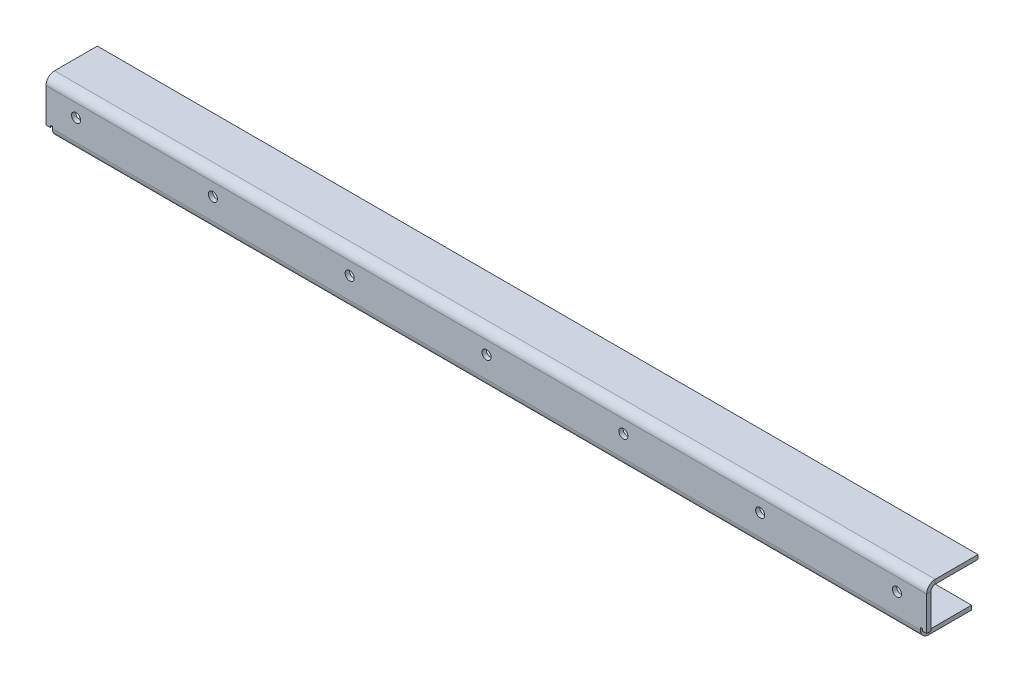
ISO-10303-21;
HEADER;
FILE_DESCRIPTION(('STEP AP214'),'2;1');
FILE_NAME('part.step','',(''),(''),'','','');
FILE_SCHEMA(('AUTOMOTIVE_DESIGN { 1 0 10303 214 1 1 1 1 }'));
ENDSEC;
DATA;
#1=APPLICATION_CONTEXT('core data for automotive mechanical design processes');
#2=APPLICATION_PROTOCOL_DEFINITION('international standard','automotive_design',2000,#1);
#3=PRODUCT_CONTEXT('',#1,'mechanical');
#4=PRODUCT('Part','Part','',(#3));
#5=PRODUCT_RELATED_PRODUCT_CATEGORY('part','',(#4));
#6=PRODUCT_DEFINITION_FORMATION('','',#4);
#7=PRODUCT_DEFINITION_CONTEXT('part definition',#1,'design');
#8=PRODUCT_DEFINITION('design','',#6,#7);
#9=PRODUCT_DEFINITION_SHAPE('','',#8);
#10=(LENGTH_UNIT() NAMED_UNIT(*) SI_UNIT(.MILLI.,.METRE.));
#11=(NAMED_UNIT(*) PLANE_ANGLE_UNIT() SI_UNIT($,.RADIAN.));
#12=(NAMED_UNIT(*) SI_UNIT($,.STERADIAN.) SOLID_ANGLE_UNIT());
#13=UNCERTAINTY_MEASURE_WITH_UNIT(LENGTH_MEASURE(1.E-05),#10,'distance_accuracy_value','');
#14=(GEOMETRIC_REPRESENTATION_CONTEXT(3) GLOBAL_UNCERTAINTY_ASSIGNED_CONTEXT((#13)) GLOBAL_UNIT_ASSIGNED_CONTEXT((#10,
#11,#12)) REPRESENTATION_CONTEXT('',''));
#15=CARTESIAN_POINT('',(0.,0.,0.));
#16=DIRECTION('',(0.,0.,1.));
#17=DIRECTION('',(1.,0.,0.));
#18=AXIS2_PLACEMENT_3D('',#15,#16,#17);
#19=CARTESIAN_POINT('',(631.951999999999,22.225,0.));
#20=DIRECTION('',(0.,0.,0.999999999999999));
#21=DIRECTION('',(0.999999999999999,0.,0.));
#22=AXIS2_PLACEMENT_3D('',#19,#20,#21);
#23=CYLINDRICAL_SURFACE('',#22,3.3734375);
#24=CARTESIAN_POINT('',(631.951999999999,22.225,0.));
#25=DIRECTION('',(0.,0.,0.999999999999999));
#26=DIRECTION('',(0.999999999999999,0.,0.));
#27=AXIS2_PLACEMENT_3D('',#24,#25,#26);
#28=CIRCLE('',#27,3.3734375);
#29=CARTESIAN_POINT('',(635.325437499999,22.225,0.));
#30=VERTEX_POINT('',#29);
#31=EDGE_CURVE('E83',#30,#30,#28,.T.);
#32=ORIENTED_EDGE('',*,*,#31,.T.);
#33=EDGE_LOOP('',(#32));
#34=FACE_BOUND('',#33,.T.);
#35=CARTESIAN_POINT('',(631.951999999999,22.225,-3.17500000000004));
#36=DIRECTION('',(0.,0.,-0.999999999999999));
#37=DIRECTION('',(-0.999999999999999,0.,0.));
#38=AXIS2_PLACEMENT_3D('',#35,#36,#37);
#39=CIRCLE('',#38,3.3734375);
#40=CARTESIAN_POINT('',(628.578562499999,22.225,-3.17500000000004));
#41=VERTEX_POINT('',#40);
#42=EDGE_CURVE('E13',#41,#41,#39,.T.);
#43=ORIENTED_EDGE('',*,*,#42,.T.);
#44=EDGE_LOOP('',(#43));
#45=FACE_BOUND('',#44,.T.);
#46=ADVANCED_FACE('F76',(#34,#45),#23,.F.);
#47=CARTESIAN_POINT('',(530.351999999999,22.225,0.));
#48=DIRECTION('',(0.,0.,0.999999999999999));
#49=DIRECTION('',(0.999999999999999,0.,0.));
#50=AXIS2_PLACEMENT_3D('',#47,#48,#49);
#51=CYLINDRICAL_SURFACE('',#50,3.3734375);
#52=CARTESIAN_POINT('',(530.351999999999,22.225,0.));
#53=DIRECTION('',(0.,0.,0.999999999999999));
#54=DIRECTION('',(0.999999999999999,0.,0.));
#55=AXIS2_PLACEMENT_3D('',#52,#53,#54);
#56=CIRCLE('',#55,3.3734375);
#57=CARTESIAN_POINT('',(533.725437499999,22.225,0.));
#58=VERTEX_POINT('',#57);
#59=EDGE_CURVE('E417',#58,#58,#56,.T.);
#60=ORIENTED_EDGE('',*,*,#59,.T.);
#61=EDGE_LOOP('',(#60));
#62=FACE_BOUND('',#61,.T.);
#63=CARTESIAN_POINT('',(530.351999999999,22.225,-3.17500000000004));
#64=DIRECTION('',(0.,0.,-0.999999999999999));
#65=DIRECTION('',(-0.999999999999999,0.,0.));
#66=AXIS2_PLACEMENT_3D('',#63,#64,#65);
#67=CIRCLE('',#66,3.3734375);
#68=CARTESIAN_POINT('',(526.978562499999,22.225,-3.17500000000004));
#69=VERTEX_POINT('',#68);
#70=EDGE_CURVE('E420',#69,#69,#67,.T.);
#71=ORIENTED_EDGE('',*,*,#70,.T.);
#72=EDGE_LOOP('',(#71));
#73=FACE_BOUND('',#72,.T.);
#74=ADVANCED_FACE('F446',(#62,#73),#51,.F.);
#75=CARTESIAN_POINT('',(428.751999999999,22.225,5.55111512312578E-13));
#76=DIRECTION('',(0.,0.,0.999999999999999));
#77=DIRECTION('',(0.999999999999999,0.,0.));
#78=AXIS2_PLACEMENT_3D('',#75,#76,#77);
#79=CYLINDRICAL_SURFACE('',#78,3.3734375);
#80=CARTESIAN_POINT('',(428.751999999999,22.225,5.55111512312578E-13));
#81=DIRECTION('',(0.,0.,0.999999999999999));
#82=DIRECTION('',(0.999999999999999,0.,0.));
#83=AXIS2_PLACEMENT_3D('',#80,#81,#82);
#84=CIRCLE('',#83,3.3734375);
#85=CARTESIAN_POINT('',(432.125437499999,22.225,5.55111512312578E-13));
#86=VERTEX_POINT('',#85);
#87=EDGE_CURVE('E411',#86,#86,#84,.T.);
#88=ORIENTED_EDGE('',*,*,#87,.T.);
#89=EDGE_LOOP('',(#88));
#90=FACE_BOUND('',#89,.T.);
#91=CARTESIAN_POINT('',(428.751999999999,22.225,-3.17499999999948));
#92=DIRECTION('',(0.,0.,-0.999999999999999));
#93=DIRECTION('',(-0.999999999999999,0.,0.));
#94=AXIS2_PLACEMENT_3D('',#91,#92,#93);
#95=CIRCLE('',#94,3.3734375);
#96=CARTESIAN_POINT('',(425.378562499999,22.225,-3.17499999999948));
#97=VERTEX_POINT('',#96);
#98=EDGE_CURVE('E414',#97,#97,#95,.T.);
#99=ORIENTED_EDGE('',*,*,#98,.T.);
#100=EDGE_LOOP('',(#99));
#101=FACE_BOUND('',#100,.T.);
#102=ADVANCED_FACE('F450',(#90,#101),#79,.F.);
#103=CARTESIAN_POINT('',(327.151999999999,22.225,5.55111512312578E-13));
#104=DIRECTION('',(0.,0.,0.999999999999999));
#105=DIRECTION('',(0.999999999999999,0.,0.));
#106=AXIS2_PLACEMENT_3D('',#103,#104,#105);
#107=CYLINDRICAL_SURFACE('',#106,3.3734375);
#108=CARTESIAN_POINT('',(327.151999999999,22.225,5.55111512312578E-13));
#109=DIRECTION('',(0.,0.,0.999999999999999));
#110=DIRECTION('',(0.999999999999999,0.,0.));
#111=AXIS2_PLACEMENT_3D('',#108,#109,#110);
#112=CIRCLE('',#111,3.3734375);
#113=CARTESIAN_POINT('',(330.525437499999,22.225,5.55111512312578E-13));
#114=VERTEX_POINT('',#113);
#115=EDGE_CURVE('E405',#114,#114,#112,.T.);
#116=ORIENTED_EDGE('',*,*,#115,.T.);
#117=EDGE_LOOP('',(#116));
#118=FACE_BOUND('',#117,.T.);
#119=CARTESIAN_POINT('',(327.151999999999,22.225,-3.17499999999948));
#120=DIRECTION('',(0.,0.,-0.999999999999999));
#121=DIRECTION('',(-0.999999999999999,0.,0.));
#122=AXIS2_PLACEMENT_3D('',#119,#120,#121);
#123=CIRCLE('',#122,3.3734375);
#124=CARTESIAN_POINT('',(323.778562499999,22.225,-3.17499999999948));
#125=VERTEX_POINT('',#124);
#126=EDGE_CURVE('E408',#125,#125,#123,.T.);
#127=ORIENTED_EDGE('',*,*,#126,.T.);
#128=EDGE_LOOP('',(#127));
#129=FACE_BOUND('',#128,.T.);
#130=ADVANCED_FACE('F455',(#118,#129),#107,.F.);
#131=CARTESIAN_POINT('',(225.552,22.225,5.55111512312578E-13));
#132=DIRECTION('',(0.,0.,0.999999999999999));
#133=DIRECTION('',(0.999999999999999,0.,0.));
#134=AXIS2_PLACEMENT_3D('',#131,#132,#133);
#135=CYLINDRICAL_SURFACE('',#134,3.3734375);
#136=CARTESIAN_POINT('',(225.552,22.225,5.55111512312578E-13));
#137=DIRECTION('',(0.,0.,0.999999999999999));
#138=DIRECTION('',(0.999999999999999,0.,0.));
#139=AXIS2_PLACEMENT_3D('',#136,#137,#138);
#140=CIRCLE('',#139,3.3734375);
#141=CARTESIAN_POINT('',(228.9254375,22.225,5.55111512312578E-13));
#142=VERTEX_POINT('',#141);
#143=EDGE_CURVE('E399',#142,#142,#140,.T.);
#144=ORIENTED_EDGE('',*,*,#143,.T.);
#145=EDGE_LOOP('',(#144));
#146=FACE_BOUND('',#145,.T.);
#147=CARTESIAN_POINT('',(225.552,22.225,-3.17499999999948));
#148=DIRECTION('',(0.,0.,-0.999999999999999));
#149=DIRECTION('',(-0.999999999999999,0.,0.));
#150=AXIS2_PLACEMENT_3D('',#147,#148,#149);
#151=CIRCLE('',#150,3.3734375);
#152=CARTESIAN_POINT('',(222.1785625,22.225,-3.17499999999948));
#153=VERTEX_POINT('',#152);
#154=EDGE_CURVE('E402',#153,#153,#151,.T.);
#155=ORIENTED_EDGE('',*,*,#154,.T.);
#156=EDGE_LOOP('',(#155));
#157=FACE_BOUND('',#156,.T.);
#158=ADVANCED_FACE('F440',(#146,#157),#135,.F.);
#159=CARTESIAN_POINT('',(0.,0.,-3.17500000000004));
#160=DIRECTION('',(0.,0.,-0.999999999999999));
#161=DIRECTION('',(-0.999999999999999,0.,0.));
#162=AXIS2_PLACEMENT_3D('',#159,#160,#161);
#163=PLANE('',#162);
#164=CARTESIAN_POINT('',(123.952,22.225,-3.17499999999948));
#165=DIRECTION('',(0.,0.,-0.999999999999999));
#166=DIRECTION('',(-0.999999999999999,0.,0.));
#167=AXIS2_PLACEMENT_3D('',#164,#165,#166);
#168=CIRCLE('',#167,3.3734375);
#169=CARTESIAN_POINT('',(120.5785625,22.225,-3.17499999999948));
#170=VERTEX_POINT('',#169);
#171=EDGE_CURVE('E589',#170,#170,#168,.T.);
#172=ORIENTED_EDGE('',*,*,#171,.F.);
#173=EDGE_LOOP('',(#172));
#174=FACE_BOUND('',#173,.T.);
#175=CARTESIAN_POINT('',(22.352,22.225,-3.17499999999993));
#176=DIRECTION('',(0.,0.,-0.999999999999999));
#177=DIRECTION('',(-0.999999999999999,0.,0.));
#178=AXIS2_PLACEMENT_3D('',#175,#176,#177);
#179=CIRCLE('',#178,3.3734375);
#180=CARTESIAN_POINT('',(18.9785625,22.225,-3.17499999999993));
#181=VERTEX_POINT('',#180);
#182=EDGE_CURVE('E256',#181,#181,#179,.T.);
#183=ORIENTED_EDGE('',*,*,#182,.F.);
#184=EDGE_LOOP('',(#183));
#185=FACE_BOUND('',#184,.T.);
#186=DIRECTION('',(0.999999999999999,0.,0.));
#187=VECTOR('',#186,1.);
#188=CARTESIAN_POINT('',(3.17499999999998,7.93749999999999,-3.17499999999993));
#189=LINE('',#188,#187);
#190=CARTESIAN_POINT('',(3.17499999999998,7.93749999999999,-3.17499999999993));
#191=VERTEX_POINT('',#190);
#192=CARTESIAN_POINT('',(4.7625,7.93749999999999,-3.17499999999993));
#193=VERTEX_POINT('',#192);
#194=EDGE_CURVE('E285',#191,#193,#189,.T.);
#195=ORIENTED_EDGE('',*,*,#194,.F.);
#196=DIRECTION('',(0.,1.,0.));
#197=VECTOR('',#196,1.);
#198=CARTESIAN_POINT('',(3.17499999999998,0.,-3.17500000000004));
#199=LINE('',#198,#197);
#200=CARTESIAN_POINT('',(3.17499999999998,6.34999999999998,-3.17499999999993));
#201=VERTEX_POINT('',#200);
#202=EDGE_CURVE('E282',#201,#191,#199,.T.);
#203=ORIENTED_EDGE('',*,*,#202,.F.);
#204=DIRECTION('',(0.999999999999999,0.,0.));
#205=VECTOR('',#204,1.);
#206=CARTESIAN_POINT('',(4.7625,6.34999999999998,-3.17499999999993));
#207=LINE('',#206,#205);
#208=CARTESIAN_POINT('',(0.,6.34999999999998,-3.17499999999993));
#209=VERTEX_POINT('',#208);
#210=EDGE_CURVE('E371',#209,#201,#207,.T.);
#211=ORIENTED_EDGE('',*,*,#210,.F.);
#212=DIRECTION('',(0.,-1.,0.));
#213=VECTOR('',#212,1.);
#214=CARTESIAN_POINT('',(0.,6.34999999999998,-3.17499999999993));
#215=LINE('',#214,#213);
#216=CARTESIAN_POINT('',(0.,31.75,-3.17500000000004));
#217=VERTEX_POINT('',#216);
#218=EDGE_CURVE('E368',#217,#209,#215,.T.);
#219=ORIENTED_EDGE('',*,*,#218,.F.);
#220=DIRECTION('',(0.999999999999999,0.,0.));
#221=VECTOR('',#220,1.);
#222=CARTESIAN_POINT('',(654.049999999999,31.75,-3.17499999999948));
#223=LINE('',#222,#221);
#224=CARTESIAN_POINT('',(654.049999999999,31.75,-3.17499999999948));
#225=VERTEX_POINT('',#224);
#226=EDGE_CURVE('E357',#225,#217,#223,.F.);
#227=ORIENTED_EDGE('',*,*,#226,.F.);
#228=DIRECTION('',(0.,1.,0.));
#229=VECTOR('',#228,1.);
#230=CARTESIAN_POINT('',(654.049999999999,6.34999999999998,-3.17500000000004));
#231=LINE('',#230,#229);
#232=CARTESIAN_POINT('',(654.049999999999,6.34999999999998,-3.17500000000004));
#233=VERTEX_POINT('',#232);
#234=EDGE_CURVE('E365',#233,#225,#231,.T.);
#235=ORIENTED_EDGE('',*,*,#234,.F.);
#236=DIRECTION('',(0.999999999999999,0.,0.));
#237=VECTOR('',#236,1.);
#238=CARTESIAN_POINT('',(654.049999999999,6.34999999999998,-3.17500000000004));
#239=LINE('',#238,#237);
#240=CARTESIAN_POINT('',(650.874999999999,6.34999999999998,-3.17500000000004));
#241=VERTEX_POINT('',#240);
#242=EDGE_CURVE('E374',#241,#233,#239,.T.);
#243=ORIENTED_EDGE('',*,*,#242,.F.);
#244=DIRECTION('',(0.,-1.,0.));
#245=VECTOR('',#244,1.);
#246=CARTESIAN_POINT('',(650.874999999999,7.93749999999999,-3.17499999999993));
#247=LINE('',#246,#245);
#248=CARTESIAN_POINT('',(650.874999999999,7.93749999999999,-3.17499999999993));
#249=VERTEX_POINT('',#248);
#250=EDGE_CURVE('E299',#249,#241,#247,.T.);
#251=ORIENTED_EDGE('',*,*,#250,.F.);
#252=DIRECTION('',(0.999999999999999,0.,0.));
#253=VECTOR('',#252,1.);
#254=CARTESIAN_POINT('',(649.287499999999,7.93749999999999,-3.17499999999993));
#255=LINE('',#254,#253);
#256=CARTESIAN_POINT('',(649.287499999999,7.93749999999999,-3.17499999999993));
#257=VERTEX_POINT('',#256);
#258=EDGE_CURVE('E295',#257,#249,#255,.T.);
#259=ORIENTED_EDGE('',*,*,#258,.F.);
#260=DIRECTION('',(0.,1.,0.));
#261=VECTOR('',#260,1.);
#262=CARTESIAN_POINT('',(649.287499999999,6.34999999999997,-3.17500000000004));
#263=LINE('',#262,#261);
#264=CARTESIAN_POINT('',(649.287499999999,6.34999999999997,-3.17500000000004));
#265=VERTEX_POINT('',#264);
#266=EDGE_CURVE('E292',#265,#257,#263,.T.);
#267=ORIENTED_EDGE('',*,*,#266,.F.);
#268=DIRECTION('',(-0.999999999999999,0.,0.));
#269=VECTOR('',#268,1.);
#270=CARTESIAN_POINT('',(4.7625,6.34999999999997,-3.17499999999993));
#271=LINE('',#270,#269);
#272=CARTESIAN_POINT('',(4.7625,6.34999999999997,-3.17499999999993));
#273=VERTEX_POINT('',#272);
#274=EDGE_CURVE('E270',#273,#265,#271,.F.);
#275=ORIENTED_EDGE('',*,*,#274,.F.);
#276=DIRECTION('',(0.,-1.,0.));
#277=VECTOR('',#276,1.);
#278=CARTESIAN_POINT('',(4.7625,7.93749999999999,-3.17499999999993));
#279=LINE('',#278,#277);
#280=EDGE_CURVE('E289',#193,#273,#279,.T.);
#281=ORIENTED_EDGE('',*,*,#280,.F.);
#282=EDGE_LOOP('',(#195,#203,#211,#219,#227,#235,#243,#251,#259,#267,#275,#281));
#283=FACE_BOUND('',#282,.T.);
#284=ORIENTED_EDGE('',*,*,#154,.F.);
#285=EDGE_LOOP('',(#284));
#286=FACE_BOUND('',#285,.T.);
#287=ORIENTED_EDGE('',*,*,#126,.F.);
#288=EDGE_LOOP('',(#287));
#289=FACE_BOUND('',#288,.T.);
#290=ORIENTED_EDGE('',*,*,#98,.F.);
#291=EDGE_LOOP('',(#290));
#292=FACE_BOUND('',#291,.T.);
#293=ORIENTED_EDGE('',*,*,#70,.F.);
#294=EDGE_LOOP('',(#293));
#295=FACE_BOUND('',#294,.T.);
#296=ORIENTED_EDGE('',*,*,#42,.F.);
#297=EDGE_LOOP('',(#296));
#298=FACE_BOUND('',#297,.T.);
#299=ADVANCED_FACE('F430',(#174,#185,#283,#286,#289,#292,#295,#298),#163,.T.);
#300=CARTESIAN_POINT('',(0.,0.,0.));
#301=DIRECTION('',(0.,0.,-0.999999999999999));
#302=DIRECTION('',(-0.999999999999999,0.,0.));
#303=AXIS2_PLACEMENT_3D('',#300,#301,#302);
#304=PLANE('',#303);
#305=CARTESIAN_POINT('',(123.952,22.225,5.55111512312578E-13));
#306=DIRECTION('',(0.,0.,0.999999999999999));
#307=DIRECTION('',(0.999999999999999,0.,0.));
#308=AXIS2_PLACEMENT_3D('',#305,#306,#307);
#309=CIRCLE('',#308,3.3734375);
#310=CARTESIAN_POINT('',(127.3254375,22.225,5.55111512312578E-13));
#311=VERTEX_POINT('',#310);
#312=EDGE_CURVE('E592',#311,#311,#309,.T.);
#313=ORIENTED_EDGE('',*,*,#312,.F.);
#314=EDGE_LOOP('',(#313));
#315=FACE_BOUND('',#314,.T.);
#316=CARTESIAN_POINT('',(22.352,22.225,0.));
#317=DIRECTION('',(0.,0.,0.999999999999999));
#318=DIRECTION('',(0.999999999999999,0.,0.));
#319=AXIS2_PLACEMENT_3D('',#316,#317,#318);
#320=CIRCLE('',#319,3.3734375);
#321=CARTESIAN_POINT('',(25.7254375,22.225,0.));
#322=VERTEX_POINT('',#321);
#323=EDGE_CURVE('E586',#322,#322,#320,.T.);
#324=ORIENTED_EDGE('',*,*,#323,.F.);
#325=EDGE_LOOP('',(#324));
#326=FACE_BOUND('',#325,.T.);
#327=DIRECTION('',(0.,-1.,0.));
#328=VECTOR('',#327,1.);
#329=CARTESIAN_POINT('',(3.17499999999998,0.,0.));
#330=LINE('',#329,#328);
#331=CARTESIAN_POINT('',(3.17499999999998,7.93749999999997,0.));
#332=VERTEX_POINT('',#331);
#333=CARTESIAN_POINT('',(3.17499999999998,6.34999999999998,0.));
#334=VERTEX_POINT('',#333);
#335=EDGE_CURVE('E90',#332,#334,#330,.T.);
#336=ORIENTED_EDGE('',*,*,#335,.F.);
#337=DIRECTION('',(-0.999999999999999,0.,0.));
#338=VECTOR('',#337,1.);
#339=CARTESIAN_POINT('',(0.,7.93749999999997,0.));
#340=LINE('',#339,#338);
#341=CARTESIAN_POINT('',(4.7625,7.93749999999997,0.));
#342=VERTEX_POINT('',#341);
#343=EDGE_CURVE('E397',#342,#332,#340,.T.);
#344=ORIENTED_EDGE('',*,*,#343,.F.);
#345=DIRECTION('',(0.,1.,0.));
#346=VECTOR('',#345,1.);
#347=CARTESIAN_POINT('',(4.7625,0.,0.));
#348=LINE('',#347,#346);
#349=CARTESIAN_POINT('',(4.7625,6.34999999999997,0.));
#350=VERTEX_POINT('',#349);
#351=EDGE_CURVE('E284',#350,#342,#348,.T.);
#352=ORIENTED_EDGE('',*,*,#351,.F.);
#353=DIRECTION('',(-0.999999999999999,0.,0.));
#354=VECTOR('',#353,1.);
#355=CARTESIAN_POINT('',(4.7625,6.34999999999997,0.));
#356=LINE('',#355,#354);
#357=CARTESIAN_POINT('',(649.287499999999,6.34999999999997,0.));
#358=VERTEX_POINT('',#357);
#359=EDGE_CURVE('E257',#350,#358,#356,.F.);
#360=ORIENTED_EDGE('',*,*,#359,.T.);
#361=DIRECTION('',(0.,-1.,0.));
#362=VECTOR('',#361,1.);
#363=CARTESIAN_POINT('',(649.287499999999,0.,5.55111512312578E-13));
#364=LINE('',#363,#362);
#365=CARTESIAN_POINT('',(649.287499999999,7.93749999999997,0.));
#366=VERTEX_POINT('',#365);
#367=EDGE_CURVE('E310',#366,#358,#364,.T.);
#368=ORIENTED_EDGE('',*,*,#367,.F.);
#369=DIRECTION('',(-0.999999999999999,0.,0.));
#370=VECTOR('',#369,1.);
#371=CARTESIAN_POINT('',(0.,7.93749999999997,0.));
#372=LINE('',#371,#370);
#373=CARTESIAN_POINT('',(650.874999999999,7.93749999999997,0.));
#374=VERTEX_POINT('',#373);
#375=EDGE_CURVE('E395',#374,#366,#372,.T.);
#376=ORIENTED_EDGE('',*,*,#375,.F.);
#377=DIRECTION('',(0.,1.,0.));
#378=VECTOR('',#377,1.);
#379=CARTESIAN_POINT('',(650.874999999999,0.,5.55111512312578E-13));
#380=LINE('',#379,#378);
#381=CARTESIAN_POINT('',(650.874999999999,6.34999999999998,0.));
#382=VERTEX_POINT('',#381);
#383=EDGE_CURVE('E312',#382,#374,#380,.T.);
#384=ORIENTED_EDGE('',*,*,#383,.F.);
#385=DIRECTION('',(0.999999999999999,0.,0.));
#386=VECTOR('',#385,1.);
#387=CARTESIAN_POINT('',(654.049999999999,6.34999999999998,0.));
#388=LINE('',#387,#386);
#389=CARTESIAN_POINT('',(654.049999999999,6.34999999999998,0.));
#390=VERTEX_POINT('',#389);
#391=EDGE_CURVE('E369',#382,#390,#388,.T.);
#392=ORIENTED_EDGE('',*,*,#391,.T.);
#393=DIRECTION('',(0.,1.,0.));
#394=VECTOR('',#393,1.);
#395=CARTESIAN_POINT('',(654.049999999999,6.34999999999998,0.));
#396=LINE('',#395,#394);
#397=CARTESIAN_POINT('',(654.049999999999,31.75,5.55111512312578E-13));
#398=VERTEX_POINT('',#397);
#399=EDGE_CURVE('E363',#390,#398,#396,.T.);
#400=ORIENTED_EDGE('',*,*,#399,.T.);
#401=DIRECTION('',(0.999999999999999,0.,0.));
#402=VECTOR('',#401,1.);
#403=CARTESIAN_POINT('',(654.049999999999,31.75,5.55111512312578E-13));
#404=LINE('',#403,#402);
#405=CARTESIAN_POINT('',(0.,31.75,0.));
#406=VERTEX_POINT('',#405);
#407=EDGE_CURVE('E345',#398,#406,#404,.F.);
#408=ORIENTED_EDGE('',*,*,#407,.T.);
#409=DIRECTION('',(0.,-1.,0.));
#410=VECTOR('',#409,1.);
#411=CARTESIAN_POINT('',(0.,6.34999999999998,0.));
#412=LINE('',#411,#410);
#413=CARTESIAN_POINT('',(0.,6.34999999999998,0.));
#414=VERTEX_POINT('',#413);
#415=EDGE_CURVE('E379',#406,#414,#412,.T.);
#416=ORIENTED_EDGE('',*,*,#415,.T.);
#417=DIRECTION('',(0.999999999999999,0.,0.));
#418=VECTOR('',#417,1.);
#419=CARTESIAN_POINT('',(4.7625,6.34999999999998,0.));
#420=LINE('',#419,#418);
#421=EDGE_CURVE('E381',#414,#334,#420,.T.);
#422=ORIENTED_EDGE('',*,*,#421,.T.);
#423=EDGE_LOOP('',(#336,#344,#352,#360,#368,#376,#384,#392,#400,#408,#416,#422));
#424=FACE_BOUND('',#423,.T.);
#425=ORIENTED_EDGE('',*,*,#143,.F.);
#426=EDGE_LOOP('',(#425));
#427=FACE_BOUND('',#426,.T.);
#428=ORIENTED_EDGE('',*,*,#115,.F.);
#429=EDGE_LOOP('',(#428));
#430=FACE_BOUND('',#429,.T.);
#431=ORIENTED_EDGE('',*,*,#87,.F.);
#432=EDGE_LOOP('',(#431));
#433=FACE_BOUND('',#432,.T.);
#434=ORIENTED_EDGE('',*,*,#59,.F.);
#435=EDGE_LOOP('',(#434));
#436=FACE_BOUND('',#435,.T.);
#437=ORIENTED_EDGE('',*,*,#31,.F.);
#438=EDGE_LOOP('',(#437));
#439=FACE_BOUND('',#438,.T.);
#440=ADVANCED_FACE('F427',(#315,#326,#424,#427,#430,#433,#436,#439),#304,.F.);
#441=CARTESIAN_POINT('',(654.049999999999,6.34999999999998,-3.17500000000004));
#442=DIRECTION('',(0.,-1.,0.));
#443=DIRECTION('',(0.,0.,-0.999999999999999));
#444=AXIS2_PLACEMENT_3D('',#441,#442,#443);
#445=PLANE('',#444);
#446=ORIENTED_EDGE('',*,*,#391,.F.);
#447=DIRECTION('',(0.,0.,-0.999999999999999));
#448=VECTOR('',#447,1.);
#449=CARTESIAN_POINT('',(650.874999999999,6.34999999999998,-3.17500000000004));
#450=LINE('',#449,#448);
#451=EDGE_CURVE('E392',#382,#241,#450,.T.);
#452=ORIENTED_EDGE('',*,*,#451,.T.);
#453=ORIENTED_EDGE('',*,*,#242,.T.);
#454=DIRECTION('',(0.,0.,0.999999999999999));
#455=VECTOR('',#454,1.);
#456=CARTESIAN_POINT('',(654.049999999999,6.34999999999998,-3.17500000000004));
#457=LINE('',#456,#455);
#458=EDGE_CURVE('E385',#233,#390,#457,.T.);
#459=ORIENTED_EDGE('',*,*,#458,.T.);
#460=EDGE_LOOP('',(#446,#452,#453,#459));
#461=FACE_BOUND('',#460,.T.);
#462=ADVANCED_FACE('F429',(#461),#445,.T.);
#463=CARTESIAN_POINT('',(4.7625,6.34999999999998,-3.17499999999993));
#464=DIRECTION('',(0.,-1.,0.));
#465=DIRECTION('',(0.,0.,-0.999999999999999));
#466=AXIS2_PLACEMENT_3D('',#463,#464,#465);
#467=PLANE('',#466);
#468=ORIENTED_EDGE('',*,*,#210,.T.);
#469=DIRECTION('',(0.,0.,0.999999999999999));
#470=VECTOR('',#469,1.);
#471=CARTESIAN_POINT('',(3.17499999999998,6.34999999999998,-3.17499999999993));
#472=LINE('',#471,#470);
#473=EDGE_CURVE('E388',#201,#334,#472,.T.);
#474=ORIENTED_EDGE('',*,*,#473,.T.);
#475=ORIENTED_EDGE('',*,*,#421,.F.);
#476=DIRECTION('',(0.,0.,0.999999999999999));
#477=VECTOR('',#476,1.);
#478=CARTESIAN_POINT('',(0.,6.34999999999998,-3.17499999999993));
#479=LINE('',#478,#477);
#480=EDGE_CURVE('E376',#209,#414,#479,.T.);
#481=ORIENTED_EDGE('',*,*,#480,.F.);
#482=EDGE_LOOP('',(#468,#474,#475,#481));
#483=FACE_BOUND('',#482,.T.);
#484=ADVANCED_FACE('F437',(#483),#467,.T.);
#485=CARTESIAN_POINT('',(654.049999999999,6.34999999999998,-3.17500000000004));
#486=DIRECTION('',(0.999999999999999,0.,0.));
#487=DIRECTION('',(0.,0.,-0.999999999999999));
#488=AXIS2_PLACEMENT_3D('',#485,#486,#487);
#489=PLANE('',#488);
#490=ORIENTED_EDGE('',*,*,#234,.T.);
#491=DIRECTION('',(0.,0.,0.999999999999999));
#492=VECTOR('',#491,1.);
#493=CARTESIAN_POINT('',(654.049999999999,31.75,-3.17499999999948));
#494=LINE('',#493,#492);
#495=EDGE_CURVE('E351',#225,#398,#494,.T.);
#496=ORIENTED_EDGE('',*,*,#495,.T.);
#497=ORIENTED_EDGE('',*,*,#399,.F.);
#498=ORIENTED_EDGE('',*,*,#458,.F.);
#499=EDGE_LOOP('',(#490,#496,#497,#498));
#500=FACE_BOUND('',#499,.T.);
#501=ADVANCED_FACE('F466',(#500),#489,.T.);
#502=CARTESIAN_POINT('',(0.,6.34999999999998,-3.17499999999993));
#503=DIRECTION('',(-0.999999999999999,0.,0.));
#504=DIRECTION('',(0.,-1.,0.));
#505=AXIS2_PLACEMENT_3D('',#502,#503,#504);
#506=PLANE('',#505);
#507=DIRECTION('',(0.,0.,0.999999999999999));
#508=VECTOR('',#507,1.);
#509=CARTESIAN_POINT('',(0.,31.75,-3.17500000000004));
#510=LINE('',#509,#508);
#511=EDGE_CURVE('E98',#217,#406,#510,.T.);
#512=ORIENTED_EDGE('',*,*,#511,.F.);
#513=ORIENTED_EDGE('',*,*,#218,.T.);
#514=ORIENTED_EDGE('',*,*,#480,.T.);
#515=ORIENTED_EDGE('',*,*,#415,.F.);
#516=EDGE_LOOP('',(#512,#513,#514,#515));
#517=FACE_BOUND('',#516,.T.);
#518=ADVANCED_FACE('F469',(#517),#506,.T.);
#519=CARTESIAN_POINT('',(0.,31.75,-6.34999999999997));
#520=DIRECTION('',(-0.999999999999999,0.,0.));
#521=DIRECTION('',(0.,0.,0.999999999999999));
#522=AXIS2_PLACEMENT_3D('',#519,#520,#521);
#523=PLANE('',#522);
#524=DIRECTION('',(0.,-1.,0.));
#525=VECTOR('',#524,1.);
#526=CARTESIAN_POINT('',(0.,38.1,-6.34999999999997));
#527=LINE('',#526,#525);
#528=CARTESIAN_POINT('',(0.,34.925,-6.34999999999997));
#529=VERTEX_POINT('',#528);
#530=CARTESIAN_POINT('',(0.,38.1,-6.34999999999997));
#531=VERTEX_POINT('',#530);
#532=EDGE_CURVE('E314',#529,#531,#527,.F.);
#533=ORIENTED_EDGE('',*,*,#532,.F.);
#534=CARTESIAN_POINT('',(0.,31.75,-6.34999999999997));
#535=DIRECTION('',(0.999999999999999,0.,0.));
#536=DIRECTION('',(0.,0.,-0.999999999999999));
#537=AXIS2_PLACEMENT_3D('',#534,#535,#536);
#538=CIRCLE('',#537,3.175);
#539=EDGE_CURVE('E354',#217,#529,#538,.F.);
#540=ORIENTED_EDGE('',*,*,#539,.F.);
#541=ORIENTED_EDGE('',*,*,#511,.T.);
#542=CARTESIAN_POINT('',(0.,31.75,-6.34999999999997));
#543=DIRECTION('',(0.999999999999999,0.,0.));
#544=DIRECTION('',(0.,0.,-0.999999999999999));
#545=AXIS2_PLACEMENT_3D('',#542,#543,#544);
#546=CIRCLE('',#545,6.35);
#547=EDGE_CURVE('E347',#406,#531,#546,.F.);
#548=ORIENTED_EDGE('',*,*,#547,.T.);
#549=EDGE_LOOP('',(#533,#540,#541,#548));
#550=FACE_BOUND('',#549,.T.);
#551=ADVANCED_FACE('F473',(#550),#523,.T.);
#552=CARTESIAN_POINT('',(654.049999999999,31.75,-6.34999999999952));
#553=DIRECTION('',(-0.999999999999999,0.,0.));
#554=DIRECTION('',(0.,0.,0.999999999999999));
#555=AXIS2_PLACEMENT_3D('',#552,#553,#554);
#556=PLANE('',#555);
#557=CARTESIAN_POINT('',(654.049999999999,31.75,-6.34999999999952));
#558=DIRECTION('',(0.999999999999999,0.,0.));
#559=DIRECTION('',(0.,0.,-0.999999999999999));
#560=AXIS2_PLACEMENT_3D('',#557,#558,#559);
#561=CIRCLE('',#560,3.175);
#562=CARTESIAN_POINT('',(654.049999999999,34.925,-6.34999999999941));
#563=VERTEX_POINT('',#562);
#564=EDGE_CURVE('E318',#563,#225,#561,.T.);
#565=ORIENTED_EDGE('',*,*,#564,.F.);
#566=DIRECTION('',(0.,-1.,0.));
#567=VECTOR('',#566,1.);
#568=CARTESIAN_POINT('',(654.049999999999,34.925,-6.34999999999941));
#569=LINE('',#568,#567);
#570=CARTESIAN_POINT('',(654.049999999999,38.1,-6.34999999999997));
#571=VERTEX_POINT('',#570);
#572=EDGE_CURVE('E338',#563,#571,#569,.F.);
#573=ORIENTED_EDGE('',*,*,#572,.T.);
#574=CARTESIAN_POINT('',(654.049999999999,31.75,-6.34999999999952));
#575=DIRECTION('',(0.999999999999999,0.,0.));
#576=DIRECTION('',(0.,0.,-0.999999999999999));
#577=AXIS2_PLACEMENT_3D('',#574,#575,#576);
#578=CIRCLE('',#577,6.35);
#579=EDGE_CURVE('E348',#571,#398,#578,.T.);
#580=ORIENTED_EDGE('',*,*,#579,.T.);
#581=ORIENTED_EDGE('',*,*,#495,.F.);
#582=EDGE_LOOP('',(#565,#573,#580,#581));
#583=FACE_BOUND('',#582,.T.);
#584=ADVANCED_FACE('F539',(#583),#556,.F.);
#585=CARTESIAN_POINT('',(654.049999999999,31.75,-6.34999999999952));
#586=DIRECTION('',(0.999999999999999,0.,0.));
#587=DIRECTION('',(0.,1.,0.));
#588=AXIS2_PLACEMENT_3D('',#585,#586,#587);
#589=CYLINDRICAL_SURFACE('',#588,6.35);
#590=ORIENTED_EDGE('',*,*,#407,.F.);
#591=ORIENTED_EDGE('',*,*,#579,.F.);
#592=DIRECTION('',(0.999999999999999,0.,0.));
#593=VECTOR('',#592,1.);
#594=CARTESIAN_POINT('',(0.,38.1,-6.34999999999997));
#595=LINE('',#594,#593);
#596=EDGE_CURVE('E336',#571,#531,#595,.F.);
#597=ORIENTED_EDGE('',*,*,#596,.T.);
#598=ORIENTED_EDGE('',*,*,#547,.F.);
#599=EDGE_LOOP('',(#590,#591,#597,#598));
#600=FACE_BOUND('',#599,.T.);
#601=ADVANCED_FACE('F498',(#600),#589,.T.);
#602=CARTESIAN_POINT('',(654.049999999999,31.75,-6.34999999999952));
#603=DIRECTION('',(0.999999999999999,0.,0.));
#604=DIRECTION('',(0.,1.,0.));
#605=AXIS2_PLACEMENT_3D('',#602,#603,#604);
#606=CYLINDRICAL_SURFACE('',#605,3.175);
#607=ORIENTED_EDGE('',*,*,#226,.T.);
#608=ORIENTED_EDGE('',*,*,#539,.T.);
#609=DIRECTION('',(0.999999999999999,0.,0.));
#610=VECTOR('',#609,1.);
#611=CARTESIAN_POINT('',(0.,34.925,-6.34999999999997));
#612=LINE('',#611,#610);
#613=EDGE_CURVE('E341',#529,#563,#612,.T.);
#614=ORIENTED_EDGE('',*,*,#613,.T.);
#615=ORIENTED_EDGE('',*,*,#564,.T.);
#616=EDGE_LOOP('',(#607,#608,#614,#615));
#617=FACE_BOUND('',#616,.T.);
#618=ADVANCED_FACE('F519',(#617),#606,.F.);
#619=CARTESIAN_POINT('',(654.049999999999,38.1000000000001,-38.1));
#620=DIRECTION('',(-0.999999999999999,0.,0.));
#621=DIRECTION('',(0.,0.,0.999999999999999));
#622=AXIS2_PLACEMENT_3D('',#619,#620,#621);
#623=PLANE('',#622);
#624=ORIENTED_EDGE('',*,*,#572,.F.);
#625=DIRECTION('',(0.,0.,0.999999999999999));
#626=VECTOR('',#625,1.);
#627=CARTESIAN_POINT('',(654.049999999999,34.9250000000001,-38.0999999999995));
#628=LINE('',#627,#626);
#629=CARTESIAN_POINT('',(654.049999999999,34.9250000000001,-38.0999999999995));
#630=VERTEX_POINT('',#629);
#631=EDGE_CURVE('E334',#563,#630,#628,.F.);
#632=ORIENTED_EDGE('',*,*,#631,.T.);
#633=DIRECTION('',(0.,-1.,0.));
#634=VECTOR('',#633,1.);
#635=CARTESIAN_POINT('',(654.049999999999,38.1000000000001,-38.1));
#636=LINE('',#635,#634);
#637=CARTESIAN_POINT('',(654.049999999999,38.1000000000001,-38.1));
#638=VERTEX_POINT('',#637);
#639=EDGE_CURVE('E315',#638,#630,#636,.T.);
#640=ORIENTED_EDGE('',*,*,#639,.F.);
#641=DIRECTION('',(0.,0.,-0.999999999999999));
#642=VECTOR('',#641,1.);
#643=CARTESIAN_POINT('',(654.049999999999,38.1,1.11022302462516E-13));
#644=LINE('',#643,#642);
#645=EDGE_CURVE('E327',#571,#638,#644,.T.);
#646=ORIENTED_EDGE('',*,*,#645,.F.);
#647=EDGE_LOOP('',(#624,#632,#640,#646));
#648=FACE_BOUND('',#647,.T.);
#649=ADVANCED_FACE('F508',(#648),#623,.F.);
#650=CARTESIAN_POINT('',(0.,38.1,-3.17499999999993));
#651=DIRECTION('',(0.999999999999999,0.,0.));
#652=DIRECTION('',(0.,0.,-0.999999999999999));
#653=AXIS2_PLACEMENT_3D('',#650,#651,#652);
#654=PLANE('',#653);
#655=ORIENTED_EDGE('',*,*,#532,.T.);
#656=DIRECTION('',(0.,0.,0.999999999999999));
#657=VECTOR('',#656,1.);
#658=CARTESIAN_POINT('',(0.,38.1,2.22044604925031E-13));
#659=LINE('',#658,#657);
#660=CARTESIAN_POINT('',(0.,38.1000000000001,-38.0999999999999));
#661=VERTEX_POINT('',#660);
#662=EDGE_CURVE('E322',#661,#531,#659,.T.);
#663=ORIENTED_EDGE('',*,*,#662,.F.);
#664=DIRECTION('',(0.,-1.,0.));
#665=VECTOR('',#664,1.);
#666=CARTESIAN_POINT('',(0.,38.1000000000001,-38.0999999999999));
#667=LINE('',#666,#665);
#668=CARTESIAN_POINT('',(0.,34.9250000000001,-38.1));
#669=VERTEX_POINT('',#668);
#670=EDGE_CURVE('E319',#661,#669,#667,.T.);
#671=ORIENTED_EDGE('',*,*,#670,.T.);
#672=DIRECTION('',(0.,0.,-0.999999999999999));
#673=VECTOR('',#672,1.);
#674=CARTESIAN_POINT('',(0.,34.925,-3.17499999999993));
#675=LINE('',#674,#673);
#676=EDGE_CURVE('E329',#669,#529,#675,.F.);
#677=ORIENTED_EDGE('',*,*,#676,.T.);
#678=EDGE_LOOP('',(#655,#663,#671,#677));
#679=FACE_BOUND('',#678,.T.);
#680=ADVANCED_FACE('F516',(#679),#654,.F.);
#681=CARTESIAN_POINT('',(0.,38.1,2.22044604925031E-13));
#682=DIRECTION('',(0.,-1.,0.));
#683=DIRECTION('',(0.,0.,-0.999999999999999));
#684=AXIS2_PLACEMENT_3D('',#681,#682,#683);
#685=PLANE('',#684);
#686=ORIENTED_EDGE('',*,*,#596,.F.);
#687=ORIENTED_EDGE('',*,*,#645,.T.);
#688=DIRECTION('',(-0.999999999999999,0.,0.));
#689=VECTOR('',#688,1.);
#690=CARTESIAN_POINT('',(0.,38.1000000000001,-38.0999999999999));
#691=LINE('',#690,#689);
#692=EDGE_CURVE('E325',#638,#661,#691,.T.);
#693=ORIENTED_EDGE('',*,*,#692,.T.);
#694=ORIENTED_EDGE('',*,*,#662,.T.);
#695=EDGE_LOOP('',(#686,#687,#693,#694));
#696=FACE_BOUND('',#695,.T.);
#697=ADVANCED_FACE('F502',(#696),#685,.F.);
#698=CARTESIAN_POINT('',(0.,34.925,1.11022302462516E-13));
#699=DIRECTION('',(0.,-1.,0.));
#700=DIRECTION('',(0.,0.,-0.999999999999999));
#701=AXIS2_PLACEMENT_3D('',#698,#699,#700);
#702=PLANE('',#701);
#703=ORIENTED_EDGE('',*,*,#631,.F.);
#704=ORIENTED_EDGE('',*,*,#613,.F.);
#705=ORIENTED_EDGE('',*,*,#676,.F.);
#706=DIRECTION('',(0.999999999999999,0.,0.));
#707=VECTOR('',#706,1.);
#708=CARTESIAN_POINT('',(0.,34.9250000000001,-38.1));
#709=LINE('',#708,#707);
#710=EDGE_CURVE('E332',#630,#669,#709,.F.);
#711=ORIENTED_EDGE('',*,*,#710,.F.);
#712=EDGE_LOOP('',(#703,#704,#705,#711));
#713=FACE_BOUND('',#712,.T.);
#714=ADVANCED_FACE('F522',(#713),#702,.T.);
#715=CARTESIAN_POINT('',(0.,38.1000000000001,-38.0999999999999));
#716=DIRECTION('',(0.,0.,0.999999999999999));
#717=DIRECTION('',(0.,-1.,0.));
#718=AXIS2_PLACEMENT_3D('',#715,#716,#717);
#719=PLANE('',#718);
#720=ORIENTED_EDGE('',*,*,#710,.T.);
#721=ORIENTED_EDGE('',*,*,#670,.F.);
#722=ORIENTED_EDGE('',*,*,#692,.F.);
#723=ORIENTED_EDGE('',*,*,#639,.T.);
#724=EDGE_LOOP('',(#720,#721,#722,#723));
#725=FACE_BOUND('',#724,.T.);
#726=ADVANCED_FACE('F512',(#725),#719,.F.);
#727=CARTESIAN_POINT('',(3.17499999999998,7.93749999999999,-3.17499999999993));
#728=DIRECTION('',(0.,-1.,0.));
#729=DIRECTION('',(0.,0.,-0.999999999999999));
#730=AXIS2_PLACEMENT_3D('',#727,#728,#729);
#731=PLANE('',#730);
#732=DIRECTION('',(0.,0.,0.999999999999999));
#733=VECTOR('',#732,1.);
#734=CARTESIAN_POINT('',(4.7625,7.93749999999999,-3.17499999999993));
#735=LINE('',#734,#733);
#736=EDGE_CURVE('E291',#193,#342,#735,.T.);
#737=ORIENTED_EDGE('',*,*,#736,.T.);
#738=ORIENTED_EDGE('',*,*,#343,.T.);
#739=DIRECTION('',(0.,0.,0.999999999999999));
#740=VECTOR('',#739,1.);
#741=CARTESIAN_POINT('',(3.17499999999998,7.93749999999999,-3.17499999999993));
#742=LINE('',#741,#740);
#743=EDGE_CURVE('E288',#191,#332,#742,.T.);
#744=ORIENTED_EDGE('',*,*,#743,.F.);
#745=ORIENTED_EDGE('',*,*,#194,.T.);
#746=EDGE_LOOP('',(#737,#738,#744,#745));
#747=FACE_BOUND('',#746,.T.);
#748=ADVANCED_FACE('F489',(#747),#731,.T.);
#749=CARTESIAN_POINT('',(649.287499999999,7.93749999999999,-3.17499999999993));
#750=DIRECTION('',(0.,-1.,0.));
#751=DIRECTION('',(0.,0.,-0.999999999999999));
#752=AXIS2_PLACEMENT_3D('',#749,#750,#751);
#753=PLANE('',#752);
#754=DIRECTION('',(0.,0.,0.999999999999999));
#755=VECTOR('',#754,1.);
#756=CARTESIAN_POINT('',(650.874999999999,7.93749999999999,-3.17499999999993));
#757=LINE('',#756,#755);
#758=EDGE_CURVE('E279',#249,#374,#757,.T.);
#759=ORIENTED_EDGE('',*,*,#758,.T.);
#760=ORIENTED_EDGE('',*,*,#375,.T.);
#761=DIRECTION('',(0.,0.,0.999999999999999));
#762=VECTOR('',#761,1.);
#763=CARTESIAN_POINT('',(649.287499999999,7.93749999999999,-3.17499999999993));
#764=LINE('',#763,#762);
#765=EDGE_CURVE('E298',#257,#366,#764,.T.);
#766=ORIENTED_EDGE('',*,*,#765,.F.);
#767=ORIENTED_EDGE('',*,*,#258,.T.);
#768=EDGE_LOOP('',(#759,#760,#766,#767));
#769=FACE_BOUND('',#768,.T.);
#770=ADVANCED_FACE('F562',(#769),#753,.T.);
#771=CARTESIAN_POINT('',(650.874999999999,7.93749999999999,-3.17499999999993));
#772=DIRECTION('',(-0.999999999999999,0.,0.));
#773=DIRECTION('',(0.,0.,0.999999999999999));
#774=AXIS2_PLACEMENT_3D('',#771,#772,#773);
#775=PLANE('',#774);
#776=ORIENTED_EDGE('',*,*,#451,.F.);
#777=ORIENTED_EDGE('',*,*,#383,.T.);
#778=ORIENTED_EDGE('',*,*,#758,.F.);
#779=ORIENTED_EDGE('',*,*,#250,.T.);
#780=EDGE_LOOP('',(#776,#777,#778,#779));
#781=FACE_BOUND('',#780,.T.);
#782=ADVANCED_FACE('F560',(#781),#775,.T.);
#783=CARTESIAN_POINT('',(649.287499999999,6.34999999999997,-3.17500000000004));
#784=DIRECTION('',(0.999999999999999,0.,0.));
#785=DIRECTION('',(0.,0.,-0.999999999999999));
#786=AXIS2_PLACEMENT_3D('',#783,#784,#785);
#787=PLANE('',#786);
#788=ORIENTED_EDGE('',*,*,#765,.T.);
#789=ORIENTED_EDGE('',*,*,#367,.T.);
#790=DIRECTION('',(0.,0.,0.999999999999999));
#791=VECTOR('',#790,1.);
#792=CARTESIAN_POINT('',(649.287499999999,6.34999999999997,-3.17500000000004));
#793=LINE('',#792,#791);
#794=EDGE_CURVE('E276',#265,#358,#793,.T.);
#795=ORIENTED_EDGE('',*,*,#794,.F.);
#796=ORIENTED_EDGE('',*,*,#266,.T.);
#797=EDGE_LOOP('',(#788,#789,#795,#796));
#798=FACE_BOUND('',#797,.T.);
#799=ADVANCED_FACE('F565',(#798),#787,.T.);
#800=CARTESIAN_POINT('',(3.17499999999998,0.,-3.17500000000004));
#801=DIRECTION('',(0.999999999999999,0.,0.));
#802=DIRECTION('',(0.,0.,-0.999999999999999));
#803=AXIS2_PLACEMENT_3D('',#800,#801,#802);
#804=PLANE('',#803);
#805=ORIENTED_EDGE('',*,*,#743,.T.);
#806=ORIENTED_EDGE('',*,*,#335,.T.);
#807=ORIENTED_EDGE('',*,*,#473,.F.);
#808=ORIENTED_EDGE('',*,*,#202,.T.);
#809=EDGE_LOOP('',(#805,#806,#807,#808));
#810=FACE_BOUND('',#809,.T.);
#811=ADVANCED_FACE('F487',(#810),#804,.T.);
#812=CARTESIAN_POINT('',(4.7625,7.93749999999999,-3.17499999999993));
#813=DIRECTION('',(-0.999999999999999,0.,0.));
#814=DIRECTION('',(0.,0.,0.999999999999999));
#815=AXIS2_PLACEMENT_3D('',#812,#813,#814);
#816=PLANE('',#815);
#817=DIRECTION('',(0.,0.,0.999999999999999));
#818=VECTOR('',#817,1.);
#819=CARTESIAN_POINT('',(4.7625,6.34999999999997,-3.17499999999993));
#820=LINE('',#819,#818);
#821=EDGE_CURVE('E264',#273,#350,#820,.T.);
#822=ORIENTED_EDGE('',*,*,#821,.T.);
#823=ORIENTED_EDGE('',*,*,#351,.T.);
#824=ORIENTED_EDGE('',*,*,#736,.F.);
#825=ORIENTED_EDGE('',*,*,#280,.T.);
#826=EDGE_LOOP('',(#822,#823,#824,#825));
#827=FACE_BOUND('',#826,.T.);
#828=ADVANCED_FACE('F629',(#827),#816,.T.);
#829=CARTESIAN_POINT('',(649.287499999999,6.34999999999998,-6.34999999999997));
#830=DIRECTION('',(0.999999999999999,0.,0.));
#831=DIRECTION('',(0.,0.,-0.999999999999999));
#832=AXIS2_PLACEMENT_3D('',#829,#830,#831);
#833=PLANE('',#832);
#834=DIRECTION('',(0.,1.,0.));
#835=VECTOR('',#834,1.);
#836=CARTESIAN_POINT('',(649.287499999999,0.,-6.34999999999941));
#837=LINE('',#836,#835);
#838=CARTESIAN_POINT('',(649.287499999999,3.17499999999999,-6.34999999999997));
#839=VERTEX_POINT('',#838);
#840=CARTESIAN_POINT('',(649.287499999999,0.,-6.34999999999941));
#841=VERTEX_POINT('',#840);
#842=EDGE_CURVE('E238',#839,#841,#837,.F.);
#843=ORIENTED_EDGE('',*,*,#842,.F.);
#844=CARTESIAN_POINT('',(649.287499999999,6.34999999999998,-6.34999999999997));
#845=DIRECTION('',(-0.999999999999999,0.,0.));
#846=DIRECTION('',(0.,0.,0.999999999999999));
#847=AXIS2_PLACEMENT_3D('',#844,#845,#846);
#848=CIRCLE('',#847,3.175);
#849=EDGE_CURVE('E267',#265,#839,#848,.F.);
#850=ORIENTED_EDGE('',*,*,#849,.F.);
#851=ORIENTED_EDGE('',*,*,#794,.T.);
#852=CARTESIAN_POINT('',(649.287499999999,6.34999999999998,-6.34999999999997));
#853=DIRECTION('',(-0.999999999999999,0.,0.));
#854=DIRECTION('',(0.,0.,0.999999999999999));
#855=AXIS2_PLACEMENT_3D('',#852,#853,#854);
#856=CIRCLE('',#855,6.35);
#857=EDGE_CURVE('E260',#358,#841,#856,.F.);
#858=ORIENTED_EDGE('',*,*,#857,.T.);
#859=EDGE_LOOP('',(#843,#850,#851,#858));
#860=FACE_BOUND('',#859,.T.);
#861=ADVANCED_FACE('F574',(#860),#833,.T.);
#862=CARTESIAN_POINT('',(4.7625,6.34999999999998,-6.34999999999997));
#863=DIRECTION('',(0.999999999999999,0.,0.));
#864=DIRECTION('',(0.,0.,-0.999999999999999));
#865=AXIS2_PLACEMENT_3D('',#862,#863,#864);
#866=PLANE('',#865);
#867=CARTESIAN_POINT('',(4.7625,6.34999999999998,-6.34999999999997));
#868=DIRECTION('',(-0.999999999999999,0.,0.));
#869=DIRECTION('',(0.,0.,0.999999999999999));
#870=AXIS2_PLACEMENT_3D('',#867,#868,#869);
#871=CIRCLE('',#870,3.175);
#872=CARTESIAN_POINT('',(4.7625,3.17499999999999,-6.34999999999997));
#873=VERTEX_POINT('',#872);
#874=EDGE_CURVE('E273',#873,#273,#871,.T.);
#875=ORIENTED_EDGE('',*,*,#874,.F.);
#876=DIRECTION('',(0.,1.,0.));
#877=VECTOR('',#876,1.);
#878=CARTESIAN_POINT('',(4.7625,3.17499999999999,-6.34999999999997));
#879=LINE('',#878,#877);
#880=CARTESIAN_POINT('',(4.7625,0.,-6.34999999999997));
#881=VERTEX_POINT('',#880);
#882=EDGE_CURVE('E250',#873,#881,#879,.F.);
#883=ORIENTED_EDGE('',*,*,#882,.T.);
#884=CARTESIAN_POINT('',(4.7625,6.34999999999998,-6.34999999999997));
#885=DIRECTION('',(-0.999999999999999,0.,0.));
#886=DIRECTION('',(0.,0.,0.999999999999999));
#887=AXIS2_PLACEMENT_3D('',#884,#885,#886);
#888=CIRCLE('',#887,6.35);
#889=EDGE_CURVE('E261',#881,#350,#888,.T.);
#890=ORIENTED_EDGE('',*,*,#889,.T.);
#891=ORIENTED_EDGE('',*,*,#821,.F.);
#892=EDGE_LOOP('',(#875,#883,#890,#891));
#893=FACE_BOUND('',#892,.T.);
#894=ADVANCED_FACE('F624',(#893),#866,.F.);
#895=CARTESIAN_POINT('',(4.7625,6.34999999999998,-6.34999999999997));
#896=DIRECTION('',(-0.999999999999999,0.,0.));
#897=DIRECTION('',(0.,-1.,0.));
#898=AXIS2_PLACEMENT_3D('',#895,#896,#897);
#899=CYLINDRICAL_SURFACE('',#898,6.35);
#900=ORIENTED_EDGE('',*,*,#359,.F.);
#901=ORIENTED_EDGE('',*,*,#889,.F.);
#902=DIRECTION('',(-0.999999999999999,0.,0.));
#903=VECTOR('',#902,1.);
#904=CARTESIAN_POINT('',(649.287499999999,0.,-6.34999999999941));
#905=LINE('',#904,#903);
#906=EDGE_CURVE('E248',#881,#841,#905,.F.);
#907=ORIENTED_EDGE('',*,*,#906,.T.);
#908=ORIENTED_EDGE('',*,*,#857,.F.);
#909=EDGE_LOOP('',(#900,#901,#907,#908));
#910=FACE_BOUND('',#909,.T.);
#911=ADVANCED_FACE('F578',(#910),#899,.T.);
#912=CARTESIAN_POINT('',(4.7625,6.34999999999998,-6.34999999999997));
#913=DIRECTION('',(-0.999999999999999,0.,0.));
#914=DIRECTION('',(0.,-1.,0.));
#915=AXIS2_PLACEMENT_3D('',#912,#913,#914);
#916=CYLINDRICAL_SURFACE('',#915,3.175);
#917=ORIENTED_EDGE('',*,*,#274,.T.);
#918=ORIENTED_EDGE('',*,*,#849,.T.);
#919=DIRECTION('',(-0.999999999999999,0.,0.));
#920=VECTOR('',#919,1.);
#921=CARTESIAN_POINT('',(649.287499999999,3.17499999999999,-6.34999999999997));
#922=LINE('',#921,#920);
#923=EDGE_CURVE('E253',#839,#873,#922,.T.);
#924=ORIENTED_EDGE('',*,*,#923,.T.);
#925=ORIENTED_EDGE('',*,*,#874,.T.);
#926=EDGE_LOOP('',(#917,#918,#924,#925));
#927=FACE_BOUND('',#926,.T.);
#928=ADVANCED_FACE('F570',(#927),#916,.F.);
#929=CARTESIAN_POINT('',(4.7625,-1.2490009027033E-13,-38.1));
#930=DIRECTION('',(0.999999999999999,0.,0.));
#931=DIRECTION('',(0.,0.,-0.999999999999999));
#932=AXIS2_PLACEMENT_3D('',#929,#930,#931);
#933=PLANE('',#932);
#934=ORIENTED_EDGE('',*,*,#882,.F.);
#935=DIRECTION('',(0.,0.,0.999999999999999));
#936=VECTOR('',#935,1.);
#937=CARTESIAN_POINT('',(4.7625,3.17499999999986,-38.1));
#938=LINE('',#937,#936);
#939=CARTESIAN_POINT('',(4.7625,3.17499999999986,-38.1));
#940=VERTEX_POINT('',#939);
#941=EDGE_CURVE('E246',#873,#940,#938,.F.);
#942=ORIENTED_EDGE('',*,*,#941,.T.);
#943=DIRECTION('',(0.,1.,0.));
#944=VECTOR('',#943,1.);
#945=CARTESIAN_POINT('',(4.7625,-1.2490009027033E-13,-38.1));
#946=LINE('',#945,#944);
#947=CARTESIAN_POINT('',(4.7625,-1.2490009027033E-13,-38.1));
#948=VERTEX_POINT('',#947);
#949=EDGE_CURVE('E234',#948,#940,#946,.T.);
#950=ORIENTED_EDGE('',*,*,#949,.F.);
#951=DIRECTION('',(0.,0.,-0.999999999999999));
#952=VECTOR('',#951,1.);
#953=CARTESIAN_POINT('',(4.7625,0.,0.));
#954=LINE('',#953,#952);
#955=EDGE_CURVE('E221',#881,#948,#954,.T.);
#956=ORIENTED_EDGE('',*,*,#955,.F.);
#957=EDGE_LOOP('',(#934,#942,#950,#956));
#958=FACE_BOUND('',#957,.T.);
#959=ADVANCED_FACE('F581',(#958),#933,.F.);
#960=CARTESIAN_POINT('',(649.287499999999,0.,-3.17499999999948));
#961=DIRECTION('',(-0.999999999999999,0.,0.));
#962=DIRECTION('',(0.,0.,0.999999999999999));
#963=AXIS2_PLACEMENT_3D('',#960,#961,#962);
#964=PLANE('',#963);
#965=ORIENTED_EDGE('',*,*,#842,.T.);
#966=DIRECTION('',(0.,0.,0.999999999999999));
#967=VECTOR('',#966,1.);
#968=CARTESIAN_POINT('',(649.287499999999,0.,5.55111512312578E-13));
#969=LINE('',#968,#967);
#970=CARTESIAN_POINT('',(649.287499999999,-1.2490009027033E-13,-38.0999999999995));
#971=VERTEX_POINT('',#970);
#972=EDGE_CURVE('E219',#971,#841,#969,.T.);
#973=ORIENTED_EDGE('',*,*,#972,.F.);
#974=DIRECTION('',(0.,1.,0.));
#975=VECTOR('',#974,1.);
#976=CARTESIAN_POINT('',(649.287499999999,-1.2490009027033E-13,-38.0999999999995));
#977=LINE('',#976,#975);
#978=CARTESIAN_POINT('',(649.287499999999,3.17499999999986,-38.1));
#979=VERTEX_POINT('',#978);
#980=EDGE_CURVE('E227',#971,#979,#977,.T.);
#981=ORIENTED_EDGE('',*,*,#980,.T.);
#982=DIRECTION('',(0.,0.,-0.999999999999999));
#983=VECTOR('',#982,1.);
#984=CARTESIAN_POINT('',(649.287499999999,3.17499999999998,-3.17500000000004));
#985=LINE('',#984,#983);
#986=EDGE_CURVE('E243',#979,#839,#985,.F.);
#987=ORIENTED_EDGE('',*,*,#986,.T.);
#988=EDGE_LOOP('',(#965,#973,#981,#987));
#989=FACE_BOUND('',#988,.T.);
#990=ADVANCED_FACE('F237',(#989),#964,.F.);
#991=CARTESIAN_POINT('',(0.,0.,0.));
#992=DIRECTION('',(0.,1.,0.));
#993=DIRECTION('',(0.,0.,0.999999999999999));
#994=AXIS2_PLACEMENT_3D('',#991,#992,#993);
#995=PLANE('',#994);
#996=ORIENTED_EDGE('',*,*,#906,.F.);
#997=ORIENTED_EDGE('',*,*,#955,.T.);
#998=DIRECTION('',(0.999999999999999,0.,0.));
#999=VECTOR('',#998,1.);
#1000=CARTESIAN_POINT('',(0.,-1.2490009027033E-13,-38.1));
#1001=LINE('',#1000,#999);
#1002=EDGE_CURVE('E214',#948,#971,#1001,.T.);
#1003=ORIENTED_EDGE('',*,*,#1002,.T.);
#1004=ORIENTED_EDGE('',*,*,#972,.T.);
#1005=EDGE_LOOP('',(#996,#997,#1003,#1004));
#1006=FACE_BOUND('',#1005,.T.);
#1007=ADVANCED_FACE('F217',(#1006),#995,.F.);
#1008=CARTESIAN_POINT('',(0.,3.17499999999999,0.));
#1009=DIRECTION('',(0.,1.,0.));
#1010=DIRECTION('',(0.,0.,0.999999999999999));
#1011=AXIS2_PLACEMENT_3D('',#1008,#1009,#1010);
#1012=PLANE('',#1011);
#1013=ORIENTED_EDGE('',*,*,#941,.F.);
#1014=ORIENTED_EDGE('',*,*,#923,.F.);
#1015=ORIENTED_EDGE('',*,*,#986,.F.);
#1016=DIRECTION('',(-0.999999999999999,0.,0.));
#1017=VECTOR('',#1016,1.);
#1018=CARTESIAN_POINT('',(649.287499999999,3.17499999999986,-38.1));
#1019=LINE('',#1018,#1017);
#1020=EDGE_CURVE('E230',#940,#979,#1019,.F.);
#1021=ORIENTED_EDGE('',*,*,#1020,.F.);
#1022=EDGE_LOOP('',(#1013,#1014,#1015,#1021));
#1023=FACE_BOUND('',#1022,.T.);
#1024=ADVANCED_FACE('F610',(#1023),#1012,.T.);
#1025=CARTESIAN_POINT('',(649.287499999999,-1.2490009027033E-13,-38.0999999999995));
#1026=DIRECTION('',(0.,0.,0.999999999999999));
#1027=DIRECTION('',(0.,-1.,0.));
#1028=AXIS2_PLACEMENT_3D('',#1025,#1026,#1027);
#1029=PLANE('',#1028);
#1030=ORIENTED_EDGE('',*,*,#1020,.T.);
#1031=ORIENTED_EDGE('',*,*,#980,.F.);
#1032=ORIENTED_EDGE('',*,*,#1002,.F.);
#1033=ORIENTED_EDGE('',*,*,#949,.T.);
#1034=EDGE_LOOP('',(#1030,#1031,#1032,#1033));
#1035=FACE_BOUND('',#1034,.T.);
#1036=ADVANCED_FACE('F228',(#1035),#1029,.F.);
#1037=CARTESIAN_POINT('',(22.352,22.225,0.));
#1038=DIRECTION('',(0.,0.,0.999999999999999));
#1039=DIRECTION('',(0.999999999999999,0.,0.));
#1040=AXIS2_PLACEMENT_3D('',#1037,#1038,#1039);
#1041=CYLINDRICAL_SURFACE('',#1040,3.3734375);
#1042=ORIENTED_EDGE('',*,*,#323,.T.);
#1043=EDGE_LOOP('',(#1042));
#1044=FACE_BOUND('',#1043,.T.);
#1045=ORIENTED_EDGE('',*,*,#182,.T.);
#1046=EDGE_LOOP('',(#1045));
#1047=FACE_BOUND('',#1046,.T.);
#1048=ADVANCED_FACE('F598',(#1044,#1047),#1041,.F.);
#1049=CARTESIAN_POINT('',(123.952,22.225,5.55111512312578E-13));
#1050=DIRECTION('',(0.,0.,0.999999999999999));
#1051=DIRECTION('',(0.999999999999999,0.,0.));
#1052=AXIS2_PLACEMENT_3D('',#1049,#1050,#1051);
#1053=CYLINDRICAL_SURFACE('',#1052,3.3734375);
#1054=ORIENTED_EDGE('',*,*,#312,.T.);
#1055=EDGE_LOOP('',(#1054));
#1056=FACE_BOUND('',#1055,.T.);
#1057=ORIENTED_EDGE('',*,*,#171,.T.);
#1058=EDGE_LOOP('',(#1057));
#1059=FACE_BOUND('',#1058,.T.);
#1060=ADVANCED_FACE('F595',(#1056,#1059),#1053,.F.);
#1061=CLOSED_SHELL('',(#46,#74,#102,#130,#158,#299,#440,#462,#484,#501,#518,#551,#584,#601,#618,
#649,#680,#697,#714,#726,#748,#770,#782,#799,#811,#828,#861,#894,#911,#928,#959,#990,#1007,
#1024,#1036,#1048,#1060));
#1062=MANIFOLD_SOLID_BREP('B2',#1061);
#1063=ADVANCED_BREP_SHAPE_REPRESENTATION('',(#18,#1062),#14);
#1064=SHAPE_DEFINITION_REPRESENTATION(#9,#1063);
ENDSEC;
END-ISO-10303-21;
